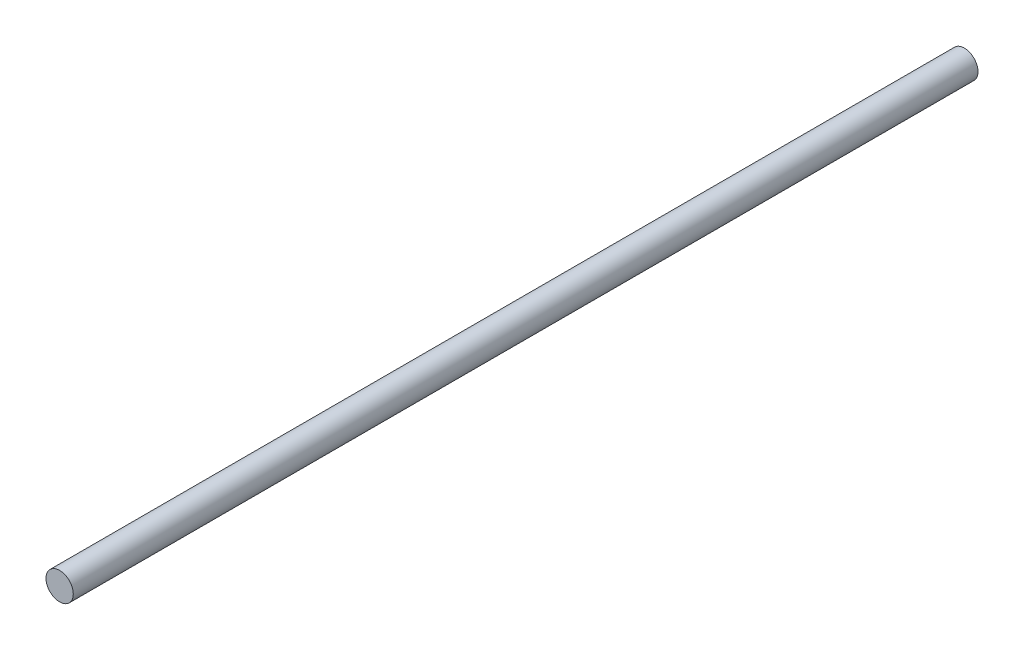
ISO-10303-21;
HEADER;
FILE_DESCRIPTION(('STEP AP214'),'2;1');
FILE_NAME('part.step','',(''),(''),'','','');
FILE_SCHEMA(('AUTOMOTIVE_DESIGN { 1 0 10303 214 1 1 1 1 }'));
ENDSEC;
DATA;
#1=APPLICATION_CONTEXT('core data for automotive mechanical design processes');
#2=APPLICATION_PROTOCOL_DEFINITION('international standard','automotive_design',2000,#1);
#3=PRODUCT_CONTEXT('',#1,'mechanical');
#4=PRODUCT('Part','Part','',(#3));
#5=PRODUCT_RELATED_PRODUCT_CATEGORY('part','',(#4));
#6=PRODUCT_DEFINITION_FORMATION('','',#4);
#7=PRODUCT_DEFINITION_CONTEXT('part definition',#1,'design');
#8=PRODUCT_DEFINITION('design','',#6,#7);
#9=PRODUCT_DEFINITION_SHAPE('','',#8);
#10=(LENGTH_UNIT() NAMED_UNIT(*) SI_UNIT(.MILLI.,.METRE.));
#11=(NAMED_UNIT(*) PLANE_ANGLE_UNIT() SI_UNIT($,.RADIAN.));
#12=(NAMED_UNIT(*) SI_UNIT($,.STERADIAN.) SOLID_ANGLE_UNIT());
#13=UNCERTAINTY_MEASURE_WITH_UNIT(LENGTH_MEASURE(1.E-05),#10,'distance_accuracy_value','');
#14=(GEOMETRIC_REPRESENTATION_CONTEXT(3) GLOBAL_UNCERTAINTY_ASSIGNED_CONTEXT((#13)) GLOBAL_UNIT_ASSIGNED_CONTEXT((#10,
#11,#12)) REPRESENTATION_CONTEXT('',''));
#15=CARTESIAN_POINT('',(0.,0.,0.));
#16=DIRECTION('',(0.,0.,1.));
#17=DIRECTION('',(1.,0.,0.));
#18=AXIS2_PLACEMENT_3D('',#15,#16,#17);
#19=CARTESIAN_POINT('',(0.,0.,210.3628));
#20=DIRECTION('',(0.,0.,-1.));
#21=DIRECTION('',(-1.,0.,0.));
#22=AXIS2_PLACEMENT_3D('',#19,#20,#21);
#23=CYLINDRICAL_SURFACE('',#22,3.175);
#24=CARTESIAN_POINT('',(0.,0.,210.3628));
#25=DIRECTION('',(0.,0.,1.));
#26=DIRECTION('',(1.,0.,0.));
#27=AXIS2_PLACEMENT_3D('',#24,#25,#26);
#28=CIRCLE('',#27,3.175);
#29=CARTESIAN_POINT('',(3.175,0.,210.3628));
#30=VERTEX_POINT('',#29);
#31=EDGE_CURVE('E10',#30,#30,#28,.T.);
#32=ORIENTED_EDGE('',*,*,#31,.F.);
#33=EDGE_LOOP('',(#32));
#34=FACE_BOUND('',#33,.T.);
#35=CARTESIAN_POINT('',(0.,0.,0.));
#36=DIRECTION('',(0.,0.,1.));
#37=DIRECTION('',(1.,0.,0.));
#38=AXIS2_PLACEMENT_3D('',#35,#36,#37);
#39=CIRCLE('',#38,3.175);
#40=CARTESIAN_POINT('',(3.175,0.,0.));
#41=VERTEX_POINT('',#40);
#42=EDGE_CURVE('E34',#41,#41,#39,.T.);
#43=ORIENTED_EDGE('',*,*,#42,.T.);
#44=EDGE_LOOP('',(#43));
#45=FACE_BOUND('',#44,.T.);
#46=ADVANCED_FACE('F31',(#34,#45),#23,.T.);
#47=CARTESIAN_POINT('',(0.,0.,210.3628));
#48=DIRECTION('',(0.,0.,1.));
#49=DIRECTION('',(1.,0.,0.));
#50=AXIS2_PLACEMENT_3D('',#47,#48,#49);
#51=PLANE('',#50);
#52=ORIENTED_EDGE('',*,*,#31,.T.);
#53=EDGE_LOOP('',(#52));
#54=FACE_BOUND('',#53,.T.);
#55=ADVANCED_FACE('F46',(#54),#51,.T.);
#56=CARTESIAN_POINT('',(0.,0.,0.));
#57=DIRECTION('',(0.,0.,1.));
#58=DIRECTION('',(1.,0.,0.));
#59=AXIS2_PLACEMENT_3D('',#56,#57,#58);
#60=PLANE('',#59);
#61=ORIENTED_EDGE('',*,*,#42,.F.);
#62=EDGE_LOOP('',(#61));
#63=FACE_BOUND('',#62,.T.);
#64=ADVANCED_FACE('F44',(#63),#60,.F.);
#65=CLOSED_SHELL('',(#46,#55,#64));
#66=MANIFOLD_SOLID_BREP('B2',#65);
#67=ADVANCED_BREP_SHAPE_REPRESENTATION('',(#18,#66),#14);
#68=SHAPE_DEFINITION_REPRESENTATION(#9,#67);
ENDSEC;
END-ISO-10303-21;
